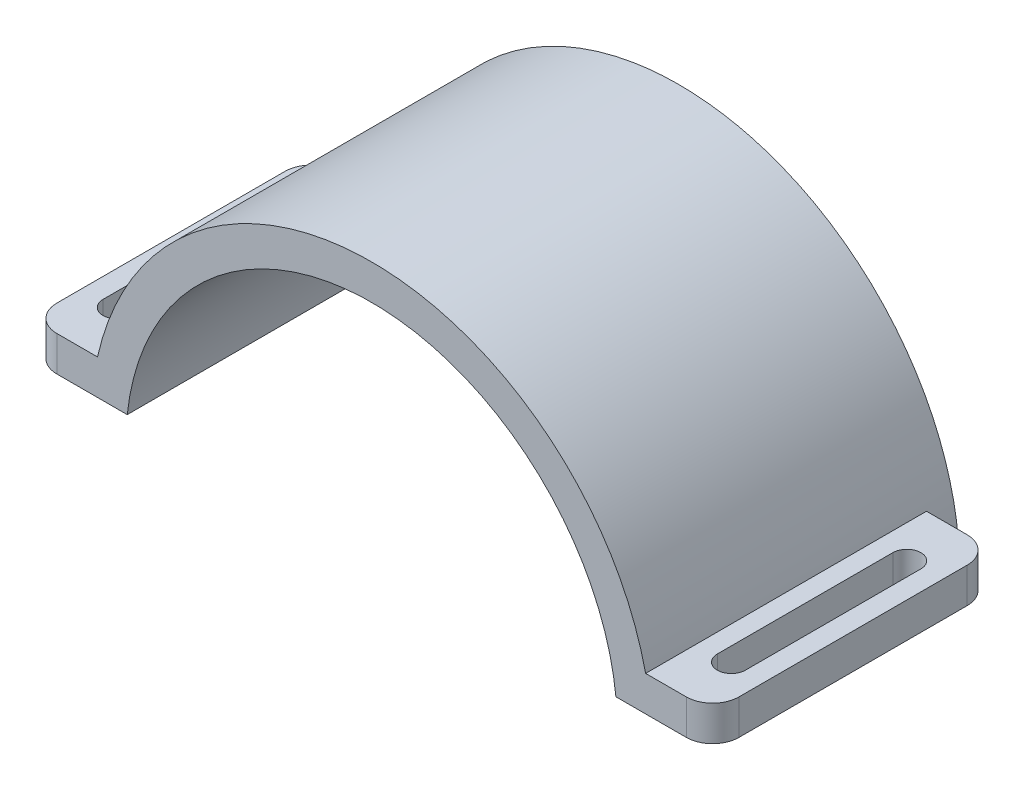
ISO-10303-21;
HEADER;
FILE_DESCRIPTION(('STEP AP214'),'2;1');
FILE_NAME('part.step','',(''),(''),'','','');
FILE_SCHEMA(('AUTOMOTIVE_DESIGN { 1 0 10303 214 1 1 1 1 }'));
ENDSEC;
DATA;
#1=APPLICATION_CONTEXT('core data for automotive mechanical design processes');
#2=APPLICATION_PROTOCOL_DEFINITION('international standard','automotive_design',2000,#1);
#3=PRODUCT_CONTEXT('',#1,'mechanical');
#4=PRODUCT('Part','Part','',(#3));
#5=PRODUCT_RELATED_PRODUCT_CATEGORY('part','',(#4));
#6=PRODUCT_DEFINITION_FORMATION('','',#4);
#7=PRODUCT_DEFINITION_CONTEXT('part definition',#1,'design');
#8=PRODUCT_DEFINITION('design','',#6,#7);
#9=PRODUCT_DEFINITION_SHAPE('','',#8);
#10=(LENGTH_UNIT() NAMED_UNIT(*) SI_UNIT(.MILLI.,.METRE.));
#11=(NAMED_UNIT(*) PLANE_ANGLE_UNIT() SI_UNIT($,.RADIAN.));
#12=(NAMED_UNIT(*) SI_UNIT($,.STERADIAN.) SOLID_ANGLE_UNIT());
#13=UNCERTAINTY_MEASURE_WITH_UNIT(LENGTH_MEASURE(1.E-05),#10,'distance_accuracy_value','');
#14=(GEOMETRIC_REPRESENTATION_CONTEXT(3) GLOBAL_UNCERTAINTY_ASSIGNED_CONTEXT((#13)) GLOBAL_UNIT_ASSIGNED_CONTEXT((#10,
#11,#12)) REPRESENTATION_CONTEXT('',''));
#15=CARTESIAN_POINT('',(0.,0.,0.));
#16=DIRECTION('',(0.,0.,1.));
#17=DIRECTION('',(1.,0.,0.));
#18=AXIS2_PLACEMENT_3D('',#15,#16,#17);
#19=CARTESIAN_POINT('',(0.,0.,40.));
#20=DIRECTION('',(0.,0.,-1.));
#21=DIRECTION('',(-1.,0.,0.));
#22=AXIS2_PLACEMENT_3D('',#19,#20,#21);
#23=CYLINDRICAL_SURFACE('',#22,28.);
#24=DIRECTION('',(0.,0.,-1.));
#25=VECTOR('',#24,1.);
#26=CARTESIAN_POINT('',(-27.8388218141501,3.,40.));
#27=LINE('',#26,#25);
#28=CARTESIAN_POINT('',(-27.8388218141501,3.,30.));
#29=VERTEX_POINT('',#28);
#30=CARTESIAN_POINT('',(-27.8388218141501,3.,65.));
#31=VERTEX_POINT('',#30);
#32=EDGE_CURVE('E263',#29,#31,#27,.F.);
#33=ORIENTED_EDGE('',*,*,#32,.F.);
#34=CARTESIAN_POINT('',(0.,0.,30.));
#35=DIRECTION('',(0.,0.,-1.));
#36=DIRECTION('',(-1.,0.,0.));
#37=AXIS2_PLACEMENT_3D('',#34,#35,#36);
#38=CIRCLE('',#37,28.);
#39=CARTESIAN_POINT('',(27.8388218141501,3.,30.));
#40=VERTEX_POINT('',#39);
#41=EDGE_CURVE('E248',#29,#40,#38,.T.);
#42=ORIENTED_EDGE('',*,*,#41,.T.);
#43=DIRECTION('',(0.,0.,-1.));
#44=VECTOR('',#43,1.);
#45=CARTESIAN_POINT('',(27.8388218141501,3.,40.));
#46=LINE('',#45,#44);
#47=CARTESIAN_POINT('',(27.8388218141501,3.,65.));
#48=VERTEX_POINT('',#47);
#49=EDGE_CURVE('E273',#48,#40,#46,.T.);
#50=ORIENTED_EDGE('',*,*,#49,.F.);
#51=CARTESIAN_POINT('',(0.,0.,65.));
#52=DIRECTION('',(0.,0.,1.));
#53=DIRECTION('',(1.,0.,0.));
#54=AXIS2_PLACEMENT_3D('',#51,#52,#53);
#55=CIRCLE('',#54,28.);
#56=EDGE_CURVE('E272',#48,#31,#55,.T.);
#57=ORIENTED_EDGE('',*,*,#56,.T.);
#58=EDGE_LOOP('',(#33,#42,#50,#57));
#59=FACE_BOUND('',#58,.T.);
#60=ADVANCED_FACE('F73',(#59),#23,.F.);
#61=CARTESIAN_POINT('',(0.,0.,40.));
#62=DIRECTION('',(0.,0.,-1.));
#63=DIRECTION('',(-1.,0.,0.));
#64=AXIS2_PLACEMENT_3D('',#61,#62,#63);
#65=CYLINDRICAL_SURFACE('',#64,32.);
#66=CARTESIAN_POINT('',(0.,0.,33.));
#67=DIRECTION('',(0.,0.,1.));
#68=DIRECTION('',(1.,0.,0.));
#69=AXIS2_PLACEMENT_3D('',#66,#67,#68);
#70=CIRCLE('',#69,32.);
#71=CARTESIAN_POINT('',(-31.224989991992,7.,33.));
#72=VERTEX_POINT('',#71);
#73=CARTESIAN_POINT('',(-31.859064644148,3.,33.));
#74=VERTEX_POINT('',#73);
#75=EDGE_CURVE('E588',#72,#74,#70,.T.);
#76=ORIENTED_EDGE('',*,*,#75,.F.);
#77=DIRECTION('',(0.,0.,1.));
#78=VECTOR('',#77,1.);
#79=CARTESIAN_POINT('',(-31.224989991992,7.,33.));
#80=LINE('',#79,#78);
#81=CARTESIAN_POINT('',(-31.224989991992,7.,65.));
#82=VERTEX_POINT('',#81);
#83=EDGE_CURVE('E597',#72,#82,#80,.T.);
#84=ORIENTED_EDGE('',*,*,#83,.T.);
#85=CARTESIAN_POINT('',(0.,0.,65.));
#86=DIRECTION('',(0.,0.,1.));
#87=DIRECTION('',(1.,0.,0.));
#88=AXIS2_PLACEMENT_3D('',#85,#86,#87);
#89=CIRCLE('',#88,32.);
#90=CARTESIAN_POINT('',(31.224989991992,7.00000000000001,65.));
#91=VERTEX_POINT('',#90);
#92=EDGE_CURVE('E341',#91,#82,#89,.T.);
#93=ORIENTED_EDGE('',*,*,#92,.F.);
#94=DIRECTION('',(0.,0.,1.));
#95=VECTOR('',#94,1.);
#96=CARTESIAN_POINT('',(31.224989991992,7.00000000000001,33.));
#97=LINE('',#96,#95);
#98=CARTESIAN_POINT('',(31.224989991992,7.00000000000001,33.));
#99=VERTEX_POINT('',#98);
#100=EDGE_CURVE('E268',#99,#91,#97,.T.);
#101=ORIENTED_EDGE('',*,*,#100,.F.);
#102=CARTESIAN_POINT('',(0.,0.,33.));
#103=DIRECTION('',(0.,0.,1.));
#104=DIRECTION('',(1.,0.,0.));
#105=AXIS2_PLACEMENT_3D('',#102,#103,#104);
#106=CIRCLE('',#105,32.);
#107=CARTESIAN_POINT('',(31.8590646440947,3.00000000056593,33.));
#108=VERTEX_POINT('',#107);
#109=EDGE_CURVE('E422',#108,#99,#106,.T.);
#110=ORIENTED_EDGE('',*,*,#109,.F.);
#111=DIRECTION('',(0.,0.,-1.));
#112=VECTOR('',#111,1.);
#113=CARTESIAN_POINT('',(31.859064644148,3.,40.));
#114=LINE('',#113,#112);
#115=CARTESIAN_POINT('',(31.8586345385164,2.99998656398991,30.0000000000797));
#116=VERTEX_POINT('',#115);
#117=EDGE_CURVE('E280',#108,#116,#114,.T.);
#118=ORIENTED_EDGE('',*,*,#117,.T.);
#119=CARTESIAN_POINT('',(0.,0.,30.));
#120=DIRECTION('',(0.,0.,-1.));
#121=DIRECTION('',(-1.,0.,0.));
#122=AXIS2_PLACEMENT_3D('',#119,#120,#121);
#123=CIRCLE('',#122,32.);
#124=CARTESIAN_POINT('',(28.9641363786882,13.6043670869596,30.));
#125=VERTEX_POINT('',#124);
#126=EDGE_CURVE('E77',#125,#116,#123,.T.);
#127=ORIENTED_EDGE('',*,*,#126,.F.);
#128=CARTESIAN_POINT('',(0.,0.,30.));
#129=DIRECTION('',(0.,0.,1.));
#130=DIRECTION('',(0.905129261834007,0.425136471467488,0.));
#131=AXIS2_PLACEMENT_3D('',#128,#129,#130);
#132=CIRCLE('',#131,32.);
#133=CARTESIAN_POINT('',(21.9466304595841,23.2883366497496,30.));
#134=VERTEX_POINT('',#133);
#135=EDGE_CURVE('E417',#125,#134,#132,.T.);
#136=ORIENTED_EDGE('',*,*,#135,.T.);
#137=CARTESIAN_POINT('',(0.,0.,30.));
#138=DIRECTION('',(0.,0.,1.));
#139=DIRECTION('',(0.685831795939499,0.727760089369019,0.));
#140=AXIS2_PLACEMENT_3D('',#137,#138,#139);
#141=CIRCLE('',#140,32.);
#142=CARTESIAN_POINT('',(9.91199468589172,30.4261898309328,30.));
#143=VERTEX_POINT('',#142);
#144=EDGE_CURVE('E442',#134,#143,#141,.T.);
#145=ORIENTED_EDGE('',*,*,#144,.T.);
#146=CARTESIAN_POINT('',(0.,0.,30.));
#147=DIRECTION('',(0.,0.,1.));
#148=DIRECTION('',(0.309749733623231,0.950818122734489,0.));
#149=AXIS2_PLACEMENT_3D('',#146,#147,#148);
#150=CIRCLE('',#149,32.);
#151=CARTESIAN_POINT('',(5.10669356346752,31.5898983988369,30.));
#152=VERTEX_POINT('',#151);
#153=EDGE_CURVE('E440',#143,#152,#150,.T.);
#154=ORIENTED_EDGE('',*,*,#153,.T.);
#155=CARTESIAN_POINT('',(0.,0.,30.));
#156=DIRECTION('',(0.,0.,1.));
#157=DIRECTION('',(0.15958417385836,0.987184324963654,0.));
#158=AXIS2_PLACEMENT_3D('',#155,#156,#157);
#159=CIRCLE('',#158,32.);
#160=CARTESIAN_POINT('',(-0.210905844615846,31.9993049725257,30.));
#161=VERTEX_POINT('',#160);
#162=EDGE_CURVE('E438',#152,#161,#159,.T.);
#163=ORIENTED_EDGE('',*,*,#162,.T.);
#164=CARTESIAN_POINT('',(0.,0.,30.));
#165=DIRECTION('',(0.,0.,1.));
#166=DIRECTION('',(-0.00659080764424514,0.999978280391428,0.));
#167=AXIS2_PLACEMENT_3D('',#164,#165,#166);
#168=CIRCLE('',#167,32.);
#169=CARTESIAN_POINT('',(-5.12198607870798,31.5874296745315,30.));
#170=VERTEX_POINT('',#169);
#171=EDGE_CURVE('E436',#161,#170,#168,.T.);
#172=ORIENTED_EDGE('',*,*,#171,.T.);
#173=CARTESIAN_POINT('',(0.,0.,30.));
#174=DIRECTION('',(0.,0.,1.));
#175=DIRECTION('',(-0.160062029511709,0.987106958089443,0.));
#176=AXIS2_PLACEMENT_3D('',#173,#174,#175);
#177=CIRCLE('',#176,32.);
#178=CARTESIAN_POINT('',(-21.946632361404,23.2883386673123,30.));
#179=VERTEX_POINT('',#178);
#180=EDGE_CURVE('E432',#170,#179,#177,.T.);
#181=ORIENTED_EDGE('',*,*,#180,.T.);
#182=CARTESIAN_POINT('',(-28.9641363786882,13.6043670869596,30.));
#183=VERTEX_POINT('',#182);
#184=EDGE_CURVE('E338',#183,#179,#123,.T.);
#185=ORIENTED_EDGE('',*,*,#184,.F.);
#186=CARTESIAN_POINT('',(-31.858634538638,2.9999865640041,30.));
#187=VERTEX_POINT('',#186);
#188=EDGE_CURVE('E337',#187,#183,#123,.T.);
#189=ORIENTED_EDGE('',*,*,#188,.F.);
#190=DIRECTION('',(0.,0.,-1.));
#191=VECTOR('',#190,1.);
#192=CARTESIAN_POINT('',(-31.859064644148,3.,40.));
#193=LINE('',#192,#191);
#194=EDGE_CURVE('E266',#187,#74,#193,.F.);
#195=ORIENTED_EDGE('',*,*,#194,.T.);
#196=EDGE_LOOP('',(#76,#84,#93,#101,#110,#118,#127,#136,#145,#154,#163,#172,#181,#185,#189,#195));
#197=FACE_BOUND('',#196,.T.);
#198=ADVANCED_FACE('F353',(#197),#65,.T.);
#199=CARTESIAN_POINT('',(0.,0.,65.));
#200=DIRECTION('',(0.,0.,1.));
#201=DIRECTION('',(1.,0.,0.));
#202=AXIS2_PLACEMENT_3D('',#199,#200,#201);
#203=PLANE('',#202);
#204=DIRECTION('',(-1.,0.,0.));
#205=VECTOR('',#204,1.);
#206=CARTESIAN_POINT('',(0.,7.,65.));
#207=LINE('',#206,#205);
#208=CARTESIAN_POINT('',(-35.8587770627481,7.,65.));
#209=VERTEX_POINT('',#208);
#210=EDGE_CURVE('E587',#82,#209,#207,.T.);
#211=ORIENTED_EDGE('',*,*,#210,.T.);
#212=DIRECTION('',(0.,1.,0.));
#213=VECTOR('',#212,1.);
#214=CARTESIAN_POINT('',(-35.8587770627481,2.99999999943406,65.));
#215=LINE('',#214,#213);
#216=CARTESIAN_POINT('',(-35.8587770627481,3.,65.));
#217=VERTEX_POINT('',#216);
#218=EDGE_CURVE('E305',#209,#217,#215,.F.);
#219=ORIENTED_EDGE('',*,*,#218,.T.);
#220=DIRECTION('',(-1.,0.,0.));
#221=VECTOR('',#220,1.);
#222=CARTESIAN_POINT('',(0.,3.,65.));
#223=LINE('',#222,#221);
#224=EDGE_CURVE('E409',#31,#217,#223,.T.);
#225=ORIENTED_EDGE('',*,*,#224,.F.);
#226=ORIENTED_EDGE('',*,*,#56,.F.);
#227=CARTESIAN_POINT('',(35.8587770626415,3.,65.));
#228=VERTEX_POINT('',#227);
#229=EDGE_CURVE('E295',#228,#48,#223,.T.);
#230=ORIENTED_EDGE('',*,*,#229,.F.);
#231=DIRECTION('',(0.,1.,0.));
#232=VECTOR('',#231,1.);
#233=CARTESIAN_POINT('',(35.8587770626415,0.,65.));
#234=LINE('',#233,#232);
#235=CARTESIAN_POINT('',(35.8587770626415,7.00000000000001,65.));
#236=VERTEX_POINT('',#235);
#237=EDGE_CURVE('E302',#228,#236,#234,.T.);
#238=ORIENTED_EDGE('',*,*,#237,.T.);
#239=DIRECTION('',(1.,0.,0.));
#240=VECTOR('',#239,1.);
#241=CARTESIAN_POINT('',(0.,7.00000000000001,65.));
#242=LINE('',#241,#240);
#243=EDGE_CURVE('E602',#91,#236,#242,.T.);
#244=ORIENTED_EDGE('',*,*,#243,.F.);
#245=ORIENTED_EDGE('',*,*,#92,.T.);
#246=EDGE_LOOP('',(#211,#219,#225,#226,#230,#238,#244,#245));
#247=FACE_BOUND('',#246,.T.);
#248=ADVANCED_FACE('F363',(#247),#203,.T.);
#249=CARTESIAN_POINT('',(-36.5187227268799,3.,30.));
#250=DIRECTION('',(0.,1.,0.));
#251=DIRECTION('',(0.,0.,1.));
#252=AXIS2_PLACEMENT_3D('',#249,#250,#251);
#253=PLANE('',#252);
#254=DIRECTION('',(0.,0.,1.));
#255=VECTOR('',#254,1.);
#256=CARTESIAN_POINT('',(-36.592254149277,3.,30.));
#257=LINE('',#256,#255);
#258=CARTESIAN_POINT('',(-36.592254149277,3.,39.));
#259=VERTEX_POINT('',#258);
#260=CARTESIAN_POINT('',(-36.592254149277,3.,59.));
#261=VERTEX_POINT('',#260);
#262=EDGE_CURVE('E556',#259,#261,#257,.T.);
#263=ORIENTED_EDGE('',*,*,#262,.T.);
#264=CARTESIAN_POINT('',(-34.992254149277,3.,59.));
#265=DIRECTION('',(0.,1.,0.));
#266=DIRECTION('',(0.,0.,1.));
#267=AXIS2_PLACEMENT_3D('',#264,#265,#266);
#268=CIRCLE('',#267,1.6);
#269=CARTESIAN_POINT('',(-33.392254149277,3.,59.));
#270=VERTEX_POINT('',#269);
#271=EDGE_CURVE('E572',#261,#270,#268,.T.);
#272=ORIENTED_EDGE('',*,*,#271,.T.);
#273=DIRECTION('',(0.,0.,-1.));
#274=VECTOR('',#273,1.);
#275=CARTESIAN_POINT('',(-33.392254149277,3.,30.));
#276=LINE('',#275,#274);
#277=CARTESIAN_POINT('',(-33.392254149277,3.,39.));
#278=VERTEX_POINT('',#277);
#279=EDGE_CURVE('E567',#270,#278,#276,.T.);
#280=ORIENTED_EDGE('',*,*,#279,.T.);
#281=CARTESIAN_POINT('',(-34.992254149277,3.,39.));
#282=DIRECTION('',(0.,1.,0.));
#283=DIRECTION('',(0.,0.,1.));
#284=AXIS2_PLACEMENT_3D('',#281,#282,#283);
#285=CIRCLE('',#284,1.6);
#286=EDGE_CURVE('E562',#278,#259,#285,.T.);
#287=ORIENTED_EDGE('',*,*,#286,.T.);
#288=EDGE_LOOP('',(#263,#272,#280,#287));
#289=FACE_BOUND('',#288,.T.);
#290=ORIENTED_EDGE('',*,*,#224,.T.);
#291=CARTESIAN_POINT('',(-35.8587770627481,3.,62.));
#292=DIRECTION('',(0.,1.,0.));
#293=DIRECTION('',(0.,0.,1.));
#294=AXIS2_PLACEMENT_3D('',#291,#292,#293);
#295=CIRCLE('',#294,3.);
#296=CARTESIAN_POINT('',(-38.8587770627481,2.99999999943406,62.));
#297=VERTEX_POINT('',#296);
#298=EDGE_CURVE('E309',#217,#297,#295,.F.);
#299=ORIENTED_EDGE('',*,*,#298,.T.);
#300=DIRECTION('',(0.,0.,1.));
#301=VECTOR('',#300,1.);
#302=CARTESIAN_POINT('',(-38.8587770627481,2.99999999943406,33.));
#303=LINE('',#302,#301);
#304=CARTESIAN_POINT('',(-38.8587770627481,2.99999999943406,36.));
#305=VERTEX_POINT('',#304);
#306=EDGE_CURVE('E599',#305,#297,#303,.T.);
#307=ORIENTED_EDGE('',*,*,#306,.F.);
#308=CARTESIAN_POINT('',(-35.8587770627481,3.,36.));
#309=DIRECTION('',(0.,1.,0.));
#310=DIRECTION('',(0.,0.,1.));
#311=AXIS2_PLACEMENT_3D('',#308,#309,#310);
#312=CIRCLE('',#311,3.);
#313=CARTESIAN_POINT('',(-35.8587770627481,2.99999999943406,33.));
#314=VERTEX_POINT('',#313);
#315=EDGE_CURVE('E307',#305,#314,#312,.F.);
#316=ORIENTED_EDGE('',*,*,#315,.T.);
#317=DIRECTION('',(-1.,0.,0.));
#318=VECTOR('',#317,1.);
#319=CARTESIAN_POINT('',(0.,2.99999999943409,33.));
#320=LINE('',#319,#318);
#321=EDGE_CURVE('E594',#74,#314,#320,.T.);
#322=ORIENTED_EDGE('',*,*,#321,.F.);
#323=ORIENTED_EDGE('',*,*,#194,.F.);
#324=DIRECTION('',(-1.,0.,0.));
#325=VECTOR('',#324,1.);
#326=CARTESIAN_POINT('',(-36.5187227268799,3.,30.));
#327=LINE('',#326,#325);
#328=EDGE_CURVE('E251',#29,#187,#327,.T.);
#329=ORIENTED_EDGE('',*,*,#328,.F.);
#330=ORIENTED_EDGE('',*,*,#32,.T.);
#331=EDGE_LOOP('',(#290,#299,#307,#316,#322,#323,#329,#330));
#332=FACE_BOUND('',#331,.T.);
#333=ADVANCED_FACE('F262',(#289,#332),#253,.F.);
#334=DIRECTION('',(0.,0.,-1.));
#335=VECTOR('',#334,1.);
#336=CARTESIAN_POINT('',(36.592254149277,3.,30.));
#337=LINE('',#336,#335);
#338=CARTESIAN_POINT('',(36.592254149277,3.,59.));
#339=VERTEX_POINT('',#338);
#340=CARTESIAN_POINT('',(36.592254149277,3.,39.));
#341=VERTEX_POINT('',#340);
#342=EDGE_CURVE('E575',#339,#341,#337,.T.);
#343=ORIENTED_EDGE('',*,*,#342,.T.);
#344=CARTESIAN_POINT('',(34.992254149277,3.,39.));
#345=DIRECTION('',(0.,1.,0.));
#346=DIRECTION('',(0.,0.,1.));
#347=AXIS2_PLACEMENT_3D('',#344,#345,#346);
#348=CIRCLE('',#347,1.6);
#349=CARTESIAN_POINT('',(33.392254149277,3.,39.));
#350=VERTEX_POINT('',#349);
#351=EDGE_CURVE('E584',#341,#350,#348,.T.);
#352=ORIENTED_EDGE('',*,*,#351,.T.);
#353=DIRECTION('',(0.,0.,1.));
#354=VECTOR('',#353,1.);
#355=CARTESIAN_POINT('',(33.392254149277,3.,30.));
#356=LINE('',#355,#354);
#357=CARTESIAN_POINT('',(33.392254149277,3.,59.));
#358=VERTEX_POINT('',#357);
#359=EDGE_CURVE('E581',#350,#358,#356,.T.);
#360=ORIENTED_EDGE('',*,*,#359,.T.);
#361=CARTESIAN_POINT('',(34.992254149277,3.,59.));
#362=DIRECTION('',(0.,1.,0.));
#363=DIRECTION('',(0.,0.,1.));
#364=AXIS2_PLACEMENT_3D('',#361,#362,#363);
#365=CIRCLE('',#364,1.6);
#366=EDGE_CURVE('E578',#358,#339,#365,.T.);
#367=ORIENTED_EDGE('',*,*,#366,.T.);
#368=EDGE_LOOP('',(#343,#352,#360,#367));
#369=FACE_BOUND('',#368,.T.);
#370=DIRECTION('',(1.,0.,0.));
#371=VECTOR('',#370,1.);
#372=CARTESIAN_POINT('',(0.,3.0000000005659,33.));
#373=LINE('',#372,#371);
#374=CARTESIAN_POINT('',(35.8587770626415,3.00000000056593,33.));
#375=VERTEX_POINT('',#374);
#376=EDGE_CURVE('E608',#108,#375,#373,.T.);
#377=ORIENTED_EDGE('',*,*,#376,.T.);
#378=CARTESIAN_POINT('',(35.8587770626415,3.,36.));
#379=DIRECTION('',(0.,1.,0.));
#380=DIRECTION('',(0.,0.,1.));
#381=AXIS2_PLACEMENT_3D('',#378,#379,#380);
#382=CIRCLE('',#381,3.);
#383=CARTESIAN_POINT('',(38.8587770626415,3.00000000056593,36.));
#384=VERTEX_POINT('',#383);
#385=EDGE_CURVE('E327',#375,#384,#382,.F.);
#386=ORIENTED_EDGE('',*,*,#385,.T.);
#387=DIRECTION('',(0.,0.,1.));
#388=VECTOR('',#387,1.);
#389=CARTESIAN_POINT('',(38.8587770626415,3.00000000056593,33.));
#390=LINE('',#389,#388);
#391=CARTESIAN_POINT('',(38.8587770626415,3.00000000056593,62.));
#392=VERTEX_POINT('',#391);
#393=EDGE_CURVE('E613',#384,#392,#390,.T.);
#394=ORIENTED_EDGE('',*,*,#393,.T.);
#395=CARTESIAN_POINT('',(35.8587770626415,3.,62.));
#396=DIRECTION('',(0.,1.,0.));
#397=DIRECTION('',(0.,0.,1.));
#398=AXIS2_PLACEMENT_3D('',#395,#396,#397);
#399=CIRCLE('',#398,3.);
#400=EDGE_CURVE('E325',#392,#228,#399,.F.);
#401=ORIENTED_EDGE('',*,*,#400,.T.);
#402=ORIENTED_EDGE('',*,*,#229,.T.);
#403=ORIENTED_EDGE('',*,*,#49,.T.);
#404=EDGE_CURVE('E254',#116,#40,#327,.T.);
#405=ORIENTED_EDGE('',*,*,#404,.F.);
#406=ORIENTED_EDGE('',*,*,#117,.F.);
#407=EDGE_LOOP('',(#377,#386,#394,#401,#402,#403,#405,#406));
#408=FACE_BOUND('',#407,.T.);
#409=ADVANCED_FACE('F426',(#369,#408),#253,.F.);
#410=CARTESIAN_POINT('',(0.,7.00000000000001,33.));
#411=DIRECTION('',(0.,-1.,0.));
#412=DIRECTION('',(0.,0.,-1.));
#413=AXIS2_PLACEMENT_3D('',#410,#411,#412);
#414=PLANE('',#413);
#415=DIRECTION('',(0.,0.,-1.));
#416=VECTOR('',#415,1.);
#417=CARTESIAN_POINT('',(33.392254149277,7.00000000000001,33.));
#418=LINE('',#417,#416);
#419=CARTESIAN_POINT('',(33.392254149277,7.00000000000001,59.));
#420=VERTEX_POINT('',#419);
#421=CARTESIAN_POINT('',(33.392254149277,7.00000000000001,39.));
#422=VERTEX_POINT('',#421);
#423=EDGE_CURVE('E83',#420,#422,#418,.T.);
#424=ORIENTED_EDGE('',*,*,#423,.T.);
#425=CARTESIAN_POINT('',(34.992254149277,7.00000000000001,39.));
#426=DIRECTION('',(0.,-1.,0.));
#427=DIRECTION('',(0.,0.,-1.));
#428=AXIS2_PLACEMENT_3D('',#425,#426,#427);
#429=CIRCLE('',#428,1.6);
#430=CARTESIAN_POINT('',(36.592254149277,7.00000000000001,39.));
#431=VERTEX_POINT('',#430);
#432=EDGE_CURVE('E12',#422,#431,#429,.T.);
#433=ORIENTED_EDGE('',*,*,#432,.T.);
#434=DIRECTION('',(0.,0.,1.));
#435=VECTOR('',#434,1.);
#436=CARTESIAN_POINT('',(36.592254149277,7.00000000000001,33.));
#437=LINE('',#436,#435);
#438=CARTESIAN_POINT('',(36.592254149277,7.00000000000001,59.));
#439=VERTEX_POINT('',#438);
#440=EDGE_CURVE('E329',#431,#439,#437,.T.);
#441=ORIENTED_EDGE('',*,*,#440,.T.);
#442=CARTESIAN_POINT('',(34.992254149277,7.00000000000001,59.));
#443=DIRECTION('',(0.,-1.,0.));
#444=DIRECTION('',(0.,0.,-1.));
#445=AXIS2_PLACEMENT_3D('',#442,#443,#444);
#446=CIRCLE('',#445,1.6);
#447=EDGE_CURVE('E332',#439,#420,#446,.T.);
#448=ORIENTED_EDGE('',*,*,#447,.T.);
#449=EDGE_LOOP('',(#424,#433,#441,#448));
#450=FACE_BOUND('',#449,.T.);
#451=DIRECTION('',(0.,0.,1.));
#452=VECTOR('',#451,1.);
#453=CARTESIAN_POINT('',(38.8587770626415,7.00000000000001,33.));
#454=LINE('',#453,#452);
#455=CARTESIAN_POINT('',(38.8587770626415,7.00000000000001,36.));
#456=VERTEX_POINT('',#455);
#457=CARTESIAN_POINT('',(38.8587770626415,7.00000000000001,62.));
#458=VERTEX_POINT('',#457);
#459=EDGE_CURVE('E618',#456,#458,#454,.T.);
#460=ORIENTED_EDGE('',*,*,#459,.F.);
#461=CARTESIAN_POINT('',(35.8587770626415,7.00000000000001,36.));
#462=DIRECTION('',(0.,-1.,0.));
#463=DIRECTION('',(0.,0.,-1.));
#464=AXIS2_PLACEMENT_3D('',#461,#462,#463);
#465=CIRCLE('',#464,3.);
#466=CARTESIAN_POINT('',(35.8587770626415,7.00000000000001,33.));
#467=VERTEX_POINT('',#466);
#468=EDGE_CURVE('E321',#456,#467,#465,.F.);
#469=ORIENTED_EDGE('',*,*,#468,.T.);
#470=DIRECTION('',(1.,0.,0.));
#471=VECTOR('',#470,1.);
#472=CARTESIAN_POINT('',(0.,7.00000000000001,33.));
#473=LINE('',#472,#471);
#474=EDGE_CURVE('E610',#99,#467,#473,.T.);
#475=ORIENTED_EDGE('',*,*,#474,.F.);
#476=ORIENTED_EDGE('',*,*,#100,.T.);
#477=ORIENTED_EDGE('',*,*,#243,.T.);
#478=CARTESIAN_POINT('',(35.8587770626415,7.00000000000001,62.));
#479=DIRECTION('',(0.,-1.,0.));
#480=DIRECTION('',(0.,0.,-1.));
#481=AXIS2_PLACEMENT_3D('',#478,#479,#480);
#482=CIRCLE('',#481,3.);
#483=EDGE_CURVE('E319',#236,#458,#482,.F.);
#484=ORIENTED_EDGE('',*,*,#483,.T.);
#485=EDGE_LOOP('',(#460,#469,#475,#476,#477,#484));
#486=FACE_BOUND('',#485,.T.);
#487=ADVANCED_FACE('F633',(#450,#486),#414,.F.);
#488=CARTESIAN_POINT('',(38.8587770626415,0.,33.));
#489=DIRECTION('',(1.,0.,0.));
#490=DIRECTION('',(0.,0.,-1.));
#491=AXIS2_PLACEMENT_3D('',#488,#489,#490);
#492=PLANE('',#491);
#493=ORIENTED_EDGE('',*,*,#393,.F.);
#494=DIRECTION('',(0.,1.,0.));
#495=VECTOR('',#494,1.);
#496=CARTESIAN_POINT('',(38.8587770626415,7.00000000000001,36.));
#497=LINE('',#496,#495);
#498=EDGE_CURVE('E316',#384,#456,#497,.T.);
#499=ORIENTED_EDGE('',*,*,#498,.T.);
#500=ORIENTED_EDGE('',*,*,#459,.T.);
#501=DIRECTION('',(0.,1.,0.));
#502=VECTOR('',#501,1.);
#503=CARTESIAN_POINT('',(38.8587770626415,0.,62.));
#504=LINE('',#503,#502);
#505=EDGE_CURVE('E314',#458,#392,#504,.F.);
#506=ORIENTED_EDGE('',*,*,#505,.T.);
#507=EDGE_LOOP('',(#493,#499,#500,#506));
#508=FACE_BOUND('',#507,.T.);
#509=ADVANCED_FACE('F694',(#508),#492,.T.);
#510=CARTESIAN_POINT('',(0.,0.,33.));
#511=DIRECTION('',(0.,0.,1.));
#512=DIRECTION('',(1.,0.,0.));
#513=AXIS2_PLACEMENT_3D('',#510,#511,#512);
#514=PLANE('',#513);
#515=ORIENTED_EDGE('',*,*,#474,.T.);
#516=DIRECTION('',(0.,1.,0.));
#517=VECTOR('',#516,1.);
#518=CARTESIAN_POINT('',(35.8587770626415,3.00000000056593,33.));
#519=LINE('',#518,#517);
#520=EDGE_CURVE('E323',#467,#375,#519,.F.);
#521=ORIENTED_EDGE('',*,*,#520,.T.);
#522=ORIENTED_EDGE('',*,*,#376,.F.);
#523=ORIENTED_EDGE('',*,*,#109,.T.);
#524=EDGE_LOOP('',(#515,#521,#522,#523));
#525=FACE_BOUND('',#524,.T.);
#526=ADVANCED_FACE('F703',(#525),#514,.F.);
#527=CARTESIAN_POINT('',(-38.8587770627481,0.,33.));
#528=DIRECTION('',(1.,0.,0.));
#529=DIRECTION('',(0.,0.,-1.));
#530=AXIS2_PLACEMENT_3D('',#527,#528,#529);
#531=PLANE('',#530);
#532=ORIENTED_EDGE('',*,*,#306,.T.);
#533=DIRECTION('',(0.,1.,0.));
#534=VECTOR('',#533,1.);
#535=CARTESIAN_POINT('',(-38.8587770627481,7.,62.));
#536=LINE('',#535,#534);
#537=CARTESIAN_POINT('',(-38.8587770627481,7.,62.));
#538=VERTEX_POINT('',#537);
#539=EDGE_CURVE('E294',#297,#538,#536,.T.);
#540=ORIENTED_EDGE('',*,*,#539,.T.);
#541=DIRECTION('',(0.,0.,1.));
#542=VECTOR('',#541,1.);
#543=CARTESIAN_POINT('',(-38.8587770627481,7.,33.));
#544=LINE('',#543,#542);
#545=CARTESIAN_POINT('',(-38.8587770627481,7.,36.));
#546=VERTEX_POINT('',#545);
#547=EDGE_CURVE('E603',#546,#538,#544,.T.);
#548=ORIENTED_EDGE('',*,*,#547,.F.);
#549=DIRECTION('',(0.,1.,0.));
#550=VECTOR('',#549,1.);
#551=CARTESIAN_POINT('',(-38.8587770627481,0.,36.));
#552=LINE('',#551,#550);
#553=EDGE_CURVE('E292',#546,#305,#552,.F.);
#554=ORIENTED_EDGE('',*,*,#553,.T.);
#555=EDGE_LOOP('',(#532,#540,#548,#554));
#556=FACE_BOUND('',#555,.T.);
#557=ADVANCED_FACE('F648',(#556),#531,.F.);
#558=CARTESIAN_POINT('',(0.,7.,33.));
#559=DIRECTION('',(0.,1.,0.));
#560=DIRECTION('',(0.,0.,1.));
#561=AXIS2_PLACEMENT_3D('',#558,#559,#560);
#562=PLANE('',#561);
#563=CARTESIAN_POINT('',(-34.992254149277,7.,59.));
#564=DIRECTION('',(0.,1.,0.));
#565=DIRECTION('',(0.,0.,1.));
#566=AXIS2_PLACEMENT_3D('',#563,#564,#565);
#567=CIRCLE('',#566,1.6);
#568=CARTESIAN_POINT('',(-36.592254149277,7.,59.));
#569=VERTEX_POINT('',#568);
#570=CARTESIAN_POINT('',(-33.392254149277,7.,59.));
#571=VERTEX_POINT('',#570);
#572=EDGE_CURVE('E570',#569,#571,#567,.T.);
#573=ORIENTED_EDGE('',*,*,#572,.F.);
#574=DIRECTION('',(0.,0.,1.));
#575=VECTOR('',#574,1.);
#576=CARTESIAN_POINT('',(-36.592254149277,7.,33.));
#577=LINE('',#576,#575);
#578=CARTESIAN_POINT('',(-36.592254149277,7.,39.));
#579=VERTEX_POINT('',#578);
#580=EDGE_CURVE('E537',#579,#569,#577,.T.);
#581=ORIENTED_EDGE('',*,*,#580,.F.);
#582=CARTESIAN_POINT('',(-34.992254149277,7.,39.));
#583=DIRECTION('',(0.,1.,0.));
#584=DIRECTION('',(0.,0.,1.));
#585=AXIS2_PLACEMENT_3D('',#582,#583,#584);
#586=CIRCLE('',#585,1.6);
#587=CARTESIAN_POINT('',(-33.392254149277,7.,39.));
#588=VERTEX_POINT('',#587);
#589=EDGE_CURVE('E559',#588,#579,#586,.T.);
#590=ORIENTED_EDGE('',*,*,#589,.F.);
#591=DIRECTION('',(0.,0.,-1.));
#592=VECTOR('',#591,1.);
#593=CARTESIAN_POINT('',(-33.392254149277,7.,33.));
#594=LINE('',#593,#592);
#595=EDGE_CURVE('E565',#571,#588,#594,.T.);
#596=ORIENTED_EDGE('',*,*,#595,.F.);
#597=EDGE_LOOP('',(#573,#581,#590,#596));
#598=FACE_BOUND('',#597,.T.);
#599=ORIENTED_EDGE('',*,*,#547,.T.);
#600=CARTESIAN_POINT('',(-35.8587770627481,7.,62.));
#601=DIRECTION('',(0.,1.,0.));
#602=DIRECTION('',(0.,0.,1.));
#603=AXIS2_PLACEMENT_3D('',#600,#601,#602);
#604=CIRCLE('',#603,3.);
#605=EDGE_CURVE('E300',#538,#209,#604,.T.);
#606=ORIENTED_EDGE('',*,*,#605,.T.);
#607=ORIENTED_EDGE('',*,*,#210,.F.);
#608=ORIENTED_EDGE('',*,*,#83,.F.);
#609=DIRECTION('',(-1.,0.,0.));
#610=VECTOR('',#609,1.);
#611=CARTESIAN_POINT('',(0.,7.,33.));
#612=LINE('',#611,#610);
#613=CARTESIAN_POINT('',(-35.8587770627481,7.,33.));
#614=VERTEX_POINT('',#613);
#615=EDGE_CURVE('E591',#72,#614,#612,.T.);
#616=ORIENTED_EDGE('',*,*,#615,.T.);
#617=CARTESIAN_POINT('',(-35.8587770627481,7.,36.));
#618=DIRECTION('',(0.,1.,0.));
#619=DIRECTION('',(0.,0.,1.));
#620=AXIS2_PLACEMENT_3D('',#617,#618,#619);
#621=CIRCLE('',#620,3.);
#622=EDGE_CURVE('E298',#614,#546,#621,.T.);
#623=ORIENTED_EDGE('',*,*,#622,.T.);
#624=EDGE_LOOP('',(#599,#606,#607,#608,#616,#623));
#625=FACE_BOUND('',#624,.T.);
#626=ADVANCED_FACE('F638',(#598,#625),#562,.T.);
#627=CARTESIAN_POINT('',(0.,0.,33.));
#628=DIRECTION('',(0.,0.,1.));
#629=DIRECTION('',(1.,0.,0.));
#630=AXIS2_PLACEMENT_3D('',#627,#628,#629);
#631=PLANE('',#630);
#632=ORIENTED_EDGE('',*,*,#321,.T.);
#633=DIRECTION('',(0.,1.,0.));
#634=VECTOR('',#633,1.);
#635=CARTESIAN_POINT('',(-35.8587770627481,0.,33.));
#636=LINE('',#635,#634);
#637=EDGE_CURVE('E311',#314,#614,#636,.T.);
#638=ORIENTED_EDGE('',*,*,#637,.T.);
#639=ORIENTED_EDGE('',*,*,#615,.F.);
#640=ORIENTED_EDGE('',*,*,#75,.T.);
#641=EDGE_LOOP('',(#632,#638,#639,#640));
#642=FACE_BOUND('',#641,.T.);
#643=ADVANCED_FACE('F640',(#642),#631,.F.);
#644=CARTESIAN_POINT('',(-35.8587770627481,0.,62.));
#645=DIRECTION('',(0.,-1.,0.));
#646=DIRECTION('',(0.,0.,-1.));
#647=AXIS2_PLACEMENT_3D('',#644,#645,#646);
#648=CYLINDRICAL_SURFACE('',#647,3.);
#649=ORIENTED_EDGE('',*,*,#298,.F.);
#650=ORIENTED_EDGE('',*,*,#218,.F.);
#651=ORIENTED_EDGE('',*,*,#605,.F.);
#652=ORIENTED_EDGE('',*,*,#539,.F.);
#653=EDGE_LOOP('',(#649,#650,#651,#652));
#654=FACE_BOUND('',#653,.T.);
#655=ADVANCED_FACE('F365',(#654),#648,.T.);
#656=CARTESIAN_POINT('',(-35.8587770627481,0.,36.));
#657=DIRECTION('',(0.,1.,0.));
#658=DIRECTION('',(0.,0.,1.));
#659=AXIS2_PLACEMENT_3D('',#656,#657,#658);
#660=CYLINDRICAL_SURFACE('',#659,3.);
#661=ORIENTED_EDGE('',*,*,#315,.F.);
#662=ORIENTED_EDGE('',*,*,#553,.F.);
#663=ORIENTED_EDGE('',*,*,#622,.F.);
#664=ORIENTED_EDGE('',*,*,#637,.F.);
#665=EDGE_LOOP('',(#661,#662,#663,#664));
#666=FACE_BOUND('',#665,.T.);
#667=ADVANCED_FACE('F644',(#666),#660,.T.);
#668=CARTESIAN_POINT('',(35.8587770626415,0.,36.));
#669=DIRECTION('',(0.,-1.,0.));
#670=DIRECTION('',(0.,0.,-1.));
#671=AXIS2_PLACEMENT_3D('',#668,#669,#670);
#672=CYLINDRICAL_SURFACE('',#671,3.);
#673=ORIENTED_EDGE('',*,*,#385,.F.);
#674=ORIENTED_EDGE('',*,*,#520,.F.);
#675=ORIENTED_EDGE('',*,*,#468,.F.);
#676=ORIENTED_EDGE('',*,*,#498,.F.);
#677=EDGE_LOOP('',(#673,#674,#675,#676));
#678=FACE_BOUND('',#677,.T.);
#679=ADVANCED_FACE('F658',(#678),#672,.T.);
#680=CARTESIAN_POINT('',(35.8587770626415,0.,62.));
#681=DIRECTION('',(0.,1.,0.));
#682=DIRECTION('',(0.,0.,1.));
#683=AXIS2_PLACEMENT_3D('',#680,#681,#682);
#684=CYLINDRICAL_SURFACE('',#683,3.);
#685=ORIENTED_EDGE('',*,*,#400,.F.);
#686=ORIENTED_EDGE('',*,*,#505,.F.);
#687=ORIENTED_EDGE('',*,*,#483,.F.);
#688=ORIENTED_EDGE('',*,*,#237,.F.);
#689=EDGE_LOOP('',(#685,#686,#687,#688));
#690=FACE_BOUND('',#689,.T.);
#691=ADVANCED_FACE('F75',(#690),#684,.T.);
#692=CARTESIAN_POINT('',(-34.992254149277,25.,59.));
#693=DIRECTION('',(0.,-1.,0.));
#694=DIRECTION('',(0.,0.,-1.));
#695=AXIS2_PLACEMENT_3D('',#692,#693,#694);
#696=CYLINDRICAL_SURFACE('',#695,1.6);
#697=DIRECTION('',(0.,-1.,0.));
#698=VECTOR('',#697,1.);
#699=CARTESIAN_POINT('',(-36.592254149277,25.,59.));
#700=LINE('',#699,#698);
#701=EDGE_CURVE('E91',#569,#261,#700,.T.);
#702=ORIENTED_EDGE('',*,*,#701,.F.);
#703=ORIENTED_EDGE('',*,*,#572,.T.);
#704=DIRECTION('',(0.,-1.,0.));
#705=VECTOR('',#704,1.);
#706=CARTESIAN_POINT('',(-33.392254149277,25.,59.));
#707=LINE('',#706,#705);
#708=EDGE_CURVE('E545',#571,#270,#707,.T.);
#709=ORIENTED_EDGE('',*,*,#708,.T.);
#710=ORIENTED_EDGE('',*,*,#271,.F.);
#711=EDGE_LOOP('',(#702,#703,#709,#710));
#712=FACE_BOUND('',#711,.T.);
#713=ADVANCED_FACE('F753',(#712),#696,.F.);
#714=CARTESIAN_POINT('',(-33.392254149277,25.,59.));
#715=DIRECTION('',(1.,0.,0.));
#716=DIRECTION('',(0.,0.,-1.));
#717=AXIS2_PLACEMENT_3D('',#714,#715,#716);
#718=PLANE('',#717);
#719=ORIENTED_EDGE('',*,*,#708,.F.);
#720=ORIENTED_EDGE('',*,*,#595,.T.);
#721=DIRECTION('',(0.,-1.,0.));
#722=VECTOR('',#721,1.);
#723=CARTESIAN_POINT('',(-33.392254149277,25.,39.));
#724=LINE('',#723,#722);
#725=EDGE_CURVE('E548',#588,#278,#724,.T.);
#726=ORIENTED_EDGE('',*,*,#725,.T.);
#727=ORIENTED_EDGE('',*,*,#279,.F.);
#728=EDGE_LOOP('',(#719,#720,#726,#727));
#729=FACE_BOUND('',#728,.T.);
#730=ADVANCED_FACE('F761',(#729),#718,.F.);
#731=CARTESIAN_POINT('',(-34.992254149277,25.,39.));
#732=DIRECTION('',(0.,-1.,0.));
#733=DIRECTION('',(0.,0.,-1.));
#734=AXIS2_PLACEMENT_3D('',#731,#732,#733);
#735=CYLINDRICAL_SURFACE('',#734,1.6);
#736=ORIENTED_EDGE('',*,*,#725,.F.);
#737=ORIENTED_EDGE('',*,*,#589,.T.);
#738=DIRECTION('',(0.,-1.,0.));
#739=VECTOR('',#738,1.);
#740=CARTESIAN_POINT('',(-36.592254149277,25.,39.));
#741=LINE('',#740,#739);
#742=EDGE_CURVE('E551',#579,#259,#741,.T.);
#743=ORIENTED_EDGE('',*,*,#742,.T.);
#744=ORIENTED_EDGE('',*,*,#286,.F.);
#745=EDGE_LOOP('',(#736,#737,#743,#744));
#746=FACE_BOUND('',#745,.T.);
#747=ADVANCED_FACE('F768',(#746),#735,.F.);
#748=CARTESIAN_POINT('',(-36.592254149277,25.,59.));
#749=DIRECTION('',(-1.,0.,0.));
#750=DIRECTION('',(0.,0.,1.));
#751=AXIS2_PLACEMENT_3D('',#748,#749,#750);
#752=PLANE('',#751);
#753=ORIENTED_EDGE('',*,*,#742,.F.);
#754=ORIENTED_EDGE('',*,*,#580,.T.);
#755=ORIENTED_EDGE('',*,*,#701,.T.);
#756=ORIENTED_EDGE('',*,*,#262,.F.);
#757=EDGE_LOOP('',(#753,#754,#755,#756));
#758=FACE_BOUND('',#757,.T.);
#759=ADVANCED_FACE('F776',(#758),#752,.F.);
#760=CARTESIAN_POINT('',(36.592254149277,25.,59.));
#761=DIRECTION('',(1.,0.,0.));
#762=DIRECTION('',(0.,0.,-1.));
#763=AXIS2_PLACEMENT_3D('',#760,#761,#762);
#764=PLANE('',#763);
#765=DIRECTION('',(0.,-1.,0.));
#766=VECTOR('',#765,1.);
#767=CARTESIAN_POINT('',(36.592254149277,25.,59.));
#768=LINE('',#767,#766);
#769=EDGE_CURVE('E541',#439,#339,#768,.T.);
#770=ORIENTED_EDGE('',*,*,#769,.F.);
#771=ORIENTED_EDGE('',*,*,#440,.F.);
#772=DIRECTION('',(0.,-1.,0.));
#773=VECTOR('',#772,1.);
#774=CARTESIAN_POINT('',(36.592254149277,25.,39.));
#775=LINE('',#774,#773);
#776=EDGE_CURVE('E99',#431,#341,#775,.T.);
#777=ORIENTED_EDGE('',*,*,#776,.T.);
#778=ORIENTED_EDGE('',*,*,#342,.F.);
#779=EDGE_LOOP('',(#770,#771,#777,#778));
#780=FACE_BOUND('',#779,.T.);
#781=ADVANCED_FACE('F784',(#780),#764,.F.);
#782=CARTESIAN_POINT('',(34.992254149277,25.,59.));
#783=DIRECTION('',(0.,-1.,0.));
#784=DIRECTION('',(0.,0.,-1.));
#785=AXIS2_PLACEMENT_3D('',#782,#783,#784);
#786=CYLINDRICAL_SURFACE('',#785,1.6);
#787=DIRECTION('',(0.,-1.,0.));
#788=VECTOR('',#787,1.);
#789=CARTESIAN_POINT('',(33.392254149277,25.,59.));
#790=LINE('',#789,#788);
#791=EDGE_CURVE('E538',#420,#358,#790,.T.);
#792=ORIENTED_EDGE('',*,*,#791,.F.);
#793=ORIENTED_EDGE('',*,*,#447,.F.);
#794=ORIENTED_EDGE('',*,*,#769,.T.);
#795=ORIENTED_EDGE('',*,*,#366,.F.);
#796=EDGE_LOOP('',(#792,#793,#794,#795));
#797=FACE_BOUND('',#796,.T.);
#798=ADVANCED_FACE('F791',(#797),#786,.F.);
#799=CARTESIAN_POINT('',(33.392254149277,25.,59.));
#800=DIRECTION('',(-1.,0.,0.));
#801=DIRECTION('',(0.,0.,1.));
#802=AXIS2_PLACEMENT_3D('',#799,#800,#801);
#803=PLANE('',#802);
#804=DIRECTION('',(0.,-1.,0.));
#805=VECTOR('',#804,1.);
#806=CARTESIAN_POINT('',(33.392254149277,25.,39.));
#807=LINE('',#806,#805);
#808=EDGE_CURVE('E529',#422,#350,#807,.T.);
#809=ORIENTED_EDGE('',*,*,#808,.F.);
#810=ORIENTED_EDGE('',*,*,#423,.F.);
#811=ORIENTED_EDGE('',*,*,#791,.T.);
#812=ORIENTED_EDGE('',*,*,#359,.F.);
#813=EDGE_LOOP('',(#809,#810,#811,#812));
#814=FACE_BOUND('',#813,.T.);
#815=ADVANCED_FACE('F464',(#814),#803,.F.);
#816=CARTESIAN_POINT('',(34.992254149277,25.,39.));
#817=DIRECTION('',(0.,-1.,0.));
#818=DIRECTION('',(0.,0.,-1.));
#819=AXIS2_PLACEMENT_3D('',#816,#817,#818);
#820=CYLINDRICAL_SURFACE('',#819,1.6);
#821=ORIENTED_EDGE('',*,*,#776,.F.);
#822=ORIENTED_EDGE('',*,*,#432,.F.);
#823=ORIENTED_EDGE('',*,*,#808,.T.);
#824=ORIENTED_EDGE('',*,*,#351,.F.);
#825=EDGE_LOOP('',(#821,#822,#823,#824));
#826=FACE_BOUND('',#825,.T.);
#827=ADVANCED_FACE('F463',(#826),#820,.F.);
#828=CARTESIAN_POINT('',(0.,0.,30.));
#829=DIRECTION('',(0.,0.,-1.));
#830=DIRECTION('',(-1.,0.,0.));
#831=AXIS2_PLACEMENT_3D('',#828,#829,#830);
#832=PLANE('',#831);
#833=ORIENTED_EDGE('',*,*,#404,.T.);
#834=ORIENTED_EDGE('',*,*,#41,.F.);
#835=ORIENTED_EDGE('',*,*,#328,.T.);
#836=ORIENTED_EDGE('',*,*,#188,.T.);
#837=ORIENTED_EDGE('',*,*,#184,.T.);
#838=ORIENTED_EDGE('',*,*,#180,.F.);
#839=ORIENTED_EDGE('',*,*,#171,.F.);
#840=ORIENTED_EDGE('',*,*,#162,.F.);
#841=ORIENTED_EDGE('',*,*,#153,.F.);
#842=ORIENTED_EDGE('',*,*,#144,.F.);
#843=ORIENTED_EDGE('',*,*,#135,.F.);
#844=ORIENTED_EDGE('',*,*,#126,.T.);
#845=EDGE_LOOP('',(#833,#834,#835,#836,#837,#838,#839,#840,#841,#842,#843,#844));
#846=FACE_BOUND('',#845,.T.);
#847=ADVANCED_FACE('F250',(#846),#832,.T.);
#848=CLOSED_SHELL('',(#60,#198,#248,#333,#409,#487,#509,#526,#557,#626,#643,#655,#667,#679,#691,
#713,#730,#747,#759,#781,#798,#815,#827,#847));
#849=MANIFOLD_SOLID_BREP('B2',#848);
#850=ADVANCED_BREP_SHAPE_REPRESENTATION('',(#18,#849),#14);
#851=SHAPE_DEFINITION_REPRESENTATION(#9,#850);
ENDSEC;
END-ISO-10303-21;
